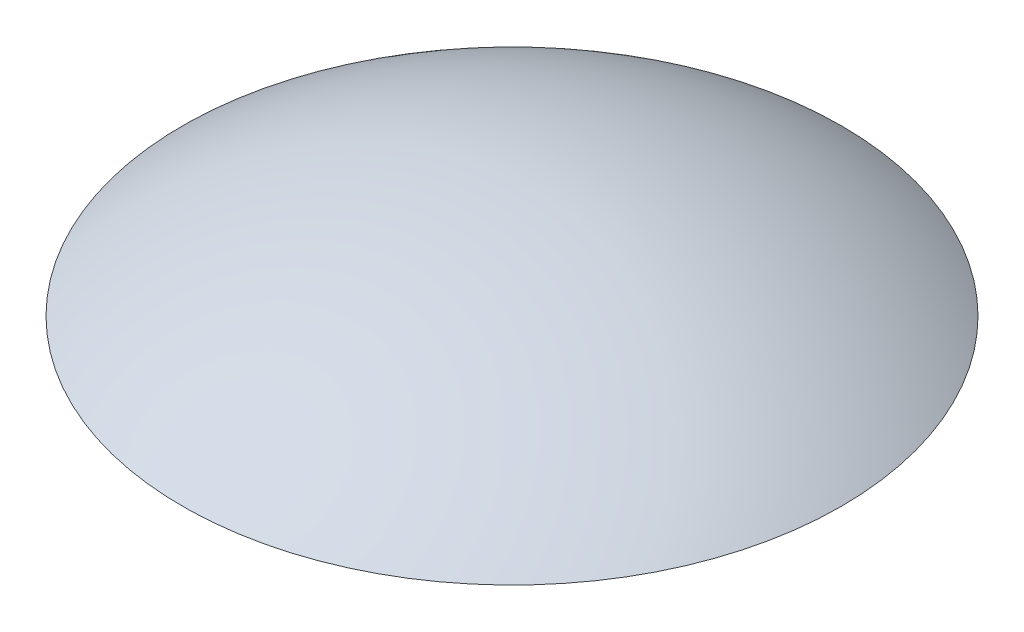
ISO-10303-21;
HEADER;
FILE_DESCRIPTION(('STEP AP214'),'2;1');
FILE_NAME('part.step','',(''),(''),'','','');
FILE_SCHEMA(('AUTOMOTIVE_DESIGN { 1 0 10303 214 1 1 1 1 }'));
ENDSEC;
DATA;
#1=APPLICATION_CONTEXT('core data for automotive mechanical design processes');
#2=APPLICATION_PROTOCOL_DEFINITION('international standard','automotive_design',2000,#1);
#3=PRODUCT_CONTEXT('',#1,'mechanical');
#4=PRODUCT('Part','Part','',(#3));
#5=PRODUCT_RELATED_PRODUCT_CATEGORY('part','',(#4));
#6=PRODUCT_DEFINITION_FORMATION('','',#4);
#7=PRODUCT_DEFINITION_CONTEXT('part definition',#1,'design');
#8=PRODUCT_DEFINITION('design','',#6,#7);
#9=PRODUCT_DEFINITION_SHAPE('','',#8);
#10=(LENGTH_UNIT() NAMED_UNIT(*) SI_UNIT(.MILLI.,.METRE.));
#11=(NAMED_UNIT(*) PLANE_ANGLE_UNIT() SI_UNIT($,.RADIAN.));
#12=(NAMED_UNIT(*) SI_UNIT($,.STERADIAN.) SOLID_ANGLE_UNIT());
#13=UNCERTAINTY_MEASURE_WITH_UNIT(LENGTH_MEASURE(1.E-05),#10,'distance_accuracy_value','');
#14=(GEOMETRIC_REPRESENTATION_CONTEXT(3) GLOBAL_UNCERTAINTY_ASSIGNED_CONTEXT((#13)) GLOBAL_UNIT_ASSIGNED_CONTEXT((#10,
#11,#12)) REPRESENTATION_CONTEXT('',''));
#15=CARTESIAN_POINT('',(0.,0.,0.));
#16=DIRECTION('',(0.,0.,1.));
#17=DIRECTION('',(1.,0.,0.));
#18=AXIS2_PLACEMENT_3D('',#15,#16,#17);
#19=CARTESIAN_POINT('',(0.,54.,0.));
#20=DIRECTION('',(0.,-1.,0.));
#21=DIRECTION('',(1.,0.,0.));
#22=AXIS2_PLACEMENT_3D('',#19,#20,#21);
#23=SPHERICAL_SURFACE('',#22,54.);
#24=CARTESIAN_POINT('',(0.,97.2890364089168,0.));
#25=DIRECTION('',(0.,-1.,0.));
#26=DIRECTION('',(0.,0.,-1.));
#27=AXIS2_PLACEMENT_3D('',#24,#25,#26);
#28=CIRCLE('',#27,32.2809437096792);
#29=CARTESIAN_POINT('',(0.,97.2890364089168,-32.2809437096792));
#30=VERTEX_POINT('',#29);
#31=EDGE_CURVE('E11',#30,#30,#28,.F.);
#32=ORIENTED_EDGE('',*,*,#31,.T.);
#33=EDGE_LOOP('',(#32));
#34=FACE_BOUND('',#33,.T.);
#35=ADVANCED_FACE('F33',(#34),#23,.T.);
#36=CARTESIAN_POINT('',(0.,97.2890364089168,0.));
#37=DIRECTION('',(0.,-1.,0.));
#38=DIRECTION('',(0.,0.,-1.));
#39=AXIS2_PLACEMENT_3D('',#36,#37,#38);
#40=PLANE('',#39);
#41=CARTESIAN_POINT('',(0.,97.2890364089168,0.));
#42=DIRECTION('',(0.,-1.,0.));
#43=DIRECTION('',(0.,0.,-1.));
#44=AXIS2_PLACEMENT_3D('',#41,#42,#43);
#45=CIRCLE('',#44,23.1570723538188);
#46=CARTESIAN_POINT('',(0.,97.2890364089168,-23.1570723538188));
#47=VERTEX_POINT('',#46);
#48=EDGE_CURVE('E43',#47,#47,#45,.T.);
#49=ORIENTED_EDGE('',*,*,#48,.F.);
#50=EDGE_LOOP('',(#49));
#51=FACE_BOUND('',#50,.T.);
#52=ORIENTED_EDGE('',*,*,#31,.F.);
#53=EDGE_LOOP('',(#52));
#54=FACE_BOUND('',#53,.T.);
#55=ADVANCED_FACE('F52',(#51,#54),#40,.T.);
#56=CARTESIAN_POINT('',(0.,108.001,0.));
#57=DIRECTION('',(0.,-1.,0.));
#58=DIRECTION('',(0.,0.,-1.));
#59=AXIS2_PLACEMENT_3D('',#56,#57,#58);
#60=CYLINDRICAL_SURFACE('',#59,23.1570723538188);
#61=ORIENTED_EDGE('',*,*,#48,.T.);
#62=EDGE_LOOP('',(#61));
#63=FACE_BOUND('',#62,.T.);
#64=CARTESIAN_POINT('',(0.,100.,0.));
#65=DIRECTION('',(0.,-1.,0.));
#66=DIRECTION('',(0.,0.,-1.));
#67=AXIS2_PLACEMENT_3D('',#64,#65,#66);
#68=CIRCLE('',#67,23.1570723538188);
#69=CARTESIAN_POINT('',(0.,100.,-23.1570723538188));
#70=VERTEX_POINT('',#69);
#71=EDGE_CURVE('E39',#70,#70,#68,.F.);
#72=ORIENTED_EDGE('',*,*,#71,.T.);
#73=EDGE_LOOP('',(#72));
#74=FACE_BOUND('',#73,.T.);
#75=ADVANCED_FACE('F50',(#63,#74),#60,.F.);
#76=CARTESIAN_POINT('',(0.,54.,0.));
#77=DIRECTION('',(0.,-1.,0.));
#78=DIRECTION('',(1.,0.,0.));
#79=AXIS2_PLACEMENT_3D('',#76,#77,#78);
#80=SPHERICAL_SURFACE('',#79,51.5);
#81=ORIENTED_EDGE('',*,*,#71,.F.);
#82=EDGE_LOOP('',(#81));
#83=FACE_BOUND('',#82,.T.);
#84=ADVANCED_FACE('F60',(#83),#80,.F.);
#85=CLOSED_SHELL('',(#35,#55,#75,#84));
#86=MANIFOLD_SOLID_BREP('B2',#85);
#87=ADVANCED_BREP_SHAPE_REPRESENTATION('',(#18,#86),#14);
#88=SHAPE_DEFINITION_REPRESENTATION(#9,#87);
ENDSEC;
END-ISO-10303-21;
